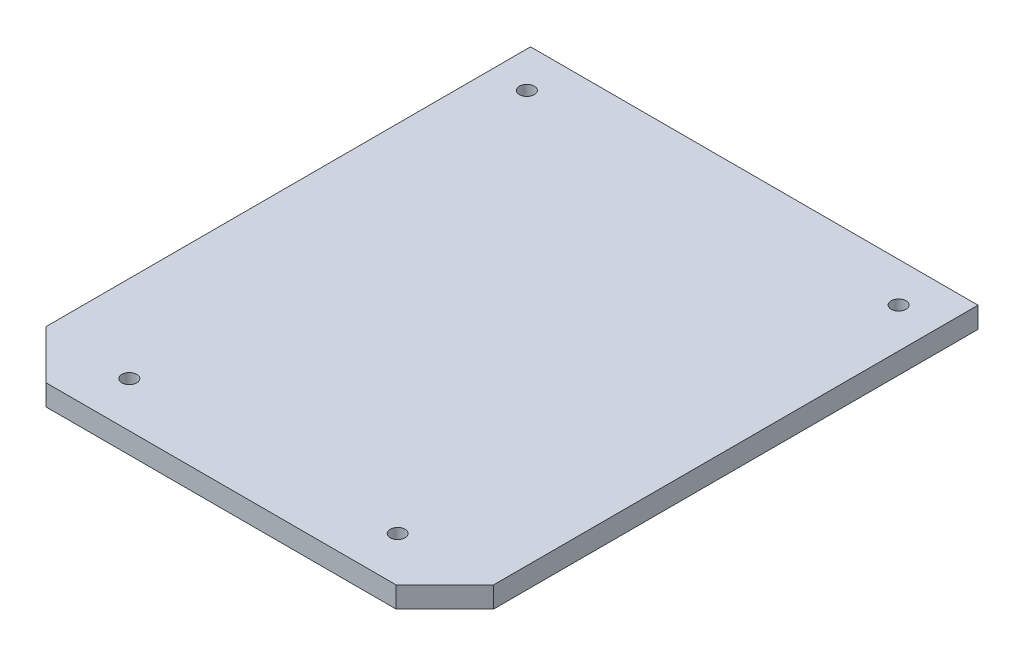
ISO-10303-21;
HEADER;
FILE_DESCRIPTION(('STEP AP214'),'2;1');
FILE_NAME('part.step','',(''),(''),'','','');
FILE_SCHEMA(('AUTOMOTIVE_DESIGN { 1 0 10303 214 1 1 1 1 }'));
ENDSEC;
DATA;
#1=APPLICATION_CONTEXT('core data for automotive mechanical design processes');
#2=APPLICATION_PROTOCOL_DEFINITION('international standard','automotive_design',2000,#1);
#3=PRODUCT_CONTEXT('',#1,'mechanical');
#4=PRODUCT('Part','Part','',(#3));
#5=PRODUCT_RELATED_PRODUCT_CATEGORY('part','',(#4));
#6=PRODUCT_DEFINITION_FORMATION('','',#4);
#7=PRODUCT_DEFINITION_CONTEXT('part definition',#1,'design');
#8=PRODUCT_DEFINITION('design','',#6,#7);
#9=PRODUCT_DEFINITION_SHAPE('','',#8);
#10=(LENGTH_UNIT() NAMED_UNIT(*) SI_UNIT(.MILLI.,.METRE.));
#11=(NAMED_UNIT(*) PLANE_ANGLE_UNIT() SI_UNIT($,.RADIAN.));
#12=(NAMED_UNIT(*) SI_UNIT($,.STERADIAN.) SOLID_ANGLE_UNIT());
#13=UNCERTAINTY_MEASURE_WITH_UNIT(LENGTH_MEASURE(1.E-05),#10,'distance_accuracy_value','');
#14=(GEOMETRIC_REPRESENTATION_CONTEXT(3) GLOBAL_UNCERTAINTY_ASSIGNED_CONTEXT((#13)) GLOBAL_UNIT_ASSIGNED_CONTEXT((#10,
#11,#12)) REPRESENTATION_CONTEXT('',''));
#15=CARTESIAN_POINT('',(0.,0.,0.));
#16=DIRECTION('',(0.,0.,1.));
#17=DIRECTION('',(1.,0.,0.));
#18=AXIS2_PLACEMENT_3D('',#15,#16,#17);
#19=CARTESIAN_POINT('',(-3.39087512506615,1.01536082259858,-29.6898459275896));
#20=DIRECTION('',(0.,0.,-1.));
#21=DIRECTION('',(-1.,0.,0.));
#22=AXIS2_PLACEMENT_3D('',#19,#20,#21);
#23=PLANE('',#22);
#24=DIRECTION('',(-1.,0.,0.));
#25=VECTOR('',#24,1.);
#26=CARTESIAN_POINT('',(-3.39087512506615,2.01536082259858,-29.6898459275896));
#27=LINE('',#26,#25);
#28=CARTESIAN_POINT('',(-3.39087512506615,2.01536082259858,-29.6898459275896));
#29=VERTEX_POINT('',#28);
#30=CARTESIAN_POINT('',(-24.7167465234432,2.01536082259858,-29.6898459275896));
#31=VERTEX_POINT('',#30);
#32=EDGE_CURVE('E117',#29,#31,#27,.T.);
#33=ORIENTED_EDGE('',*,*,#32,.F.);
#34=DIRECTION('',(0.,1.,0.));
#35=VECTOR('',#34,1.);
#36=CARTESIAN_POINT('',(-3.39087512506615,1.01536082259858,-29.6898459275896));
#37=LINE('',#36,#35);
#38=CARTESIAN_POINT('',(-3.39087512506615,1.01536082259858,-29.6898459275896));
#39=VERTEX_POINT('',#38);
#40=EDGE_CURVE('E11',#39,#29,#37,.T.);
#41=ORIENTED_EDGE('',*,*,#40,.F.);
#42=DIRECTION('',(-1.,0.,0.));
#43=VECTOR('',#42,1.);
#44=CARTESIAN_POINT('',(-3.39087512506615,1.01536082259858,-29.6898459275896));
#45=LINE('',#44,#43);
#46=CARTESIAN_POINT('',(-24.7167465234432,1.01536082259858,-29.6898459275896));
#47=VERTEX_POINT('',#46);
#48=EDGE_CURVE('E132',#39,#47,#45,.T.);
#49=ORIENTED_EDGE('',*,*,#48,.T.);
#50=DIRECTION('',(0.,1.,0.));
#51=VECTOR('',#50,1.);
#52=CARTESIAN_POINT('',(-24.7167465234432,1.01536082259858,-29.6898459275896));
#53=LINE('',#52,#51);
#54=EDGE_CURVE('E35',#47,#31,#53,.T.);
#55=ORIENTED_EDGE('',*,*,#54,.T.);
#56=EDGE_LOOP('',(#33,#41,#49,#55));
#57=FACE_BOUND('',#56,.T.);
#58=ADVANCED_FACE('F32',(#57),#23,.T.);
#59=CARTESIAN_POINT('',(-3.39087512506615,1.01536082259858,-6.5966371205072));
#60=DIRECTION('',(1.,0.,0.));
#61=DIRECTION('',(0.,0.,-1.));
#62=AXIS2_PLACEMENT_3D('',#59,#60,#61);
#63=PLANE('',#62);
#64=DIRECTION('',(0.,0.,-1.));
#65=VECTOR('',#64,1.);
#66=CARTESIAN_POINT('',(-3.39087512506615,2.01536082259858,-6.5966371205072));
#67=LINE('',#66,#65);
#68=CARTESIAN_POINT('',(-3.39087512506615,2.01536082259858,-6.5966371205072));
#69=VERTEX_POINT('',#68);
#70=EDGE_CURVE('E130',#69,#29,#67,.T.);
#71=ORIENTED_EDGE('',*,*,#70,.F.);
#72=DIRECTION('',(0.,1.,0.));
#73=VECTOR('',#72,1.);
#74=CARTESIAN_POINT('',(-3.39087512506615,1.01536082259858,-6.5966371205072));
#75=LINE('',#74,#73);
#76=CARTESIAN_POINT('',(-3.39087512506615,1.01536082259858,-6.5966371205072));
#77=VERTEX_POINT('',#76);
#78=EDGE_CURVE('E41',#77,#69,#75,.T.);
#79=ORIENTED_EDGE('',*,*,#78,.F.);
#80=DIRECTION('',(0.,0.,-1.));
#81=VECTOR('',#80,1.);
#82=CARTESIAN_POINT('',(-3.39087512506615,1.01536082259858,-6.5966371205072));
#83=LINE('',#82,#81);
#84=EDGE_CURVE('E107',#77,#39,#83,.T.);
#85=ORIENTED_EDGE('',*,*,#84,.T.);
#86=ORIENTED_EDGE('',*,*,#40,.T.);
#87=EDGE_LOOP('',(#71,#79,#85,#86));
#88=FACE_BOUND('',#87,.T.);
#89=ADVANCED_FACE('F140',(#88),#63,.T.);
#90=CARTESIAN_POINT('',(-5.70805083870186,1.01536082259858,-4.27946140687141));
#91=DIRECTION('',(0.707106781186559,0.,0.707106781186536));
#92=DIRECTION('',(0.707106781186536,0.,-0.707106781186559));
#93=AXIS2_PLACEMENT_3D('',#90,#91,#92);
#94=PLANE('',#93);
#95=DIRECTION('',(0.707106781186536,0.,-0.707106781186559));
#96=VECTOR('',#95,1.);
#97=CARTESIAN_POINT('',(-5.70805083870186,2.01536082259858,-4.27946140687141));
#98=LINE('',#97,#96);
#99=CARTESIAN_POINT('',(-5.70805083870186,2.01536082259858,-4.27946140687141));
#100=VERTEX_POINT('',#99);
#101=EDGE_CURVE('E94',#100,#69,#98,.T.);
#102=ORIENTED_EDGE('',*,*,#101,.F.);
#103=DIRECTION('',(0.,1.,0.));
#104=VECTOR('',#103,1.);
#105=CARTESIAN_POINT('',(-5.70805083870186,1.01536082259858,-4.27946140687141));
#106=LINE('',#105,#104);
#107=CARTESIAN_POINT('',(-5.70805083870186,1.01536082259858,-4.27946140687141));
#108=VERTEX_POINT('',#107);
#109=EDGE_CURVE('E89',#108,#100,#106,.T.);
#110=ORIENTED_EDGE('',*,*,#109,.F.);
#111=DIRECTION('',(0.707106781186536,0.,-0.707106781186559));
#112=VECTOR('',#111,1.);
#113=CARTESIAN_POINT('',(-5.70805083870186,1.01536082259858,-4.27946140687141));
#114=LINE('',#113,#112);
#115=EDGE_CURVE('E92',#108,#77,#114,.T.);
#116=ORIENTED_EDGE('',*,*,#115,.T.);
#117=ORIENTED_EDGE('',*,*,#78,.T.);
#118=EDGE_LOOP('',(#102,#110,#116,#117));
#119=FACE_BOUND('',#118,.T.);
#120=ADVANCED_FACE('F91',(#119),#94,.T.);
#121=CARTESIAN_POINT('',(-22.3995708098073,1.01536082259858,-4.27946140687141));
#122=DIRECTION('',(0.,0.,1.));
#123=DIRECTION('',(1.,0.,0.));
#124=AXIS2_PLACEMENT_3D('',#121,#122,#123);
#125=PLANE('',#124);
#126=DIRECTION('',(1.,0.,0.));
#127=VECTOR('',#126,1.);
#128=CARTESIAN_POINT('',(-22.3995708098073,2.01536082259858,-4.27946140687141));
#129=LINE('',#128,#127);
#130=CARTESIAN_POINT('',(-22.3995708098073,2.01536082259858,-4.27946140687141));
#131=VERTEX_POINT('',#130);
#132=EDGE_CURVE('E127',#131,#100,#129,.T.);
#133=ORIENTED_EDGE('',*,*,#132,.F.);
#134=DIRECTION('',(0.,1.,0.));
#135=VECTOR('',#134,1.);
#136=CARTESIAN_POINT('',(-22.3995708098073,1.01536082259858,-4.27946140687141));
#137=LINE('',#136,#135);
#138=CARTESIAN_POINT('',(-22.3995708098073,1.01536082259858,-4.27946140687141));
#139=VERTEX_POINT('',#138);
#140=EDGE_CURVE('E99',#139,#131,#137,.T.);
#141=ORIENTED_EDGE('',*,*,#140,.F.);
#142=DIRECTION('',(1.,0.,0.));
#143=VECTOR('',#142,1.);
#144=CARTESIAN_POINT('',(-22.3995708098073,1.01536082259858,-4.27946140687141));
#145=LINE('',#144,#143);
#146=EDGE_CURVE('E105',#139,#108,#145,.T.);
#147=ORIENTED_EDGE('',*,*,#146,.T.);
#148=ORIENTED_EDGE('',*,*,#109,.T.);
#149=EDGE_LOOP('',(#133,#141,#147,#148));
#150=FACE_BOUND('',#149,.T.);
#151=ADVANCED_FACE('F109',(#150),#125,.T.);
#152=CARTESIAN_POINT('',(-24.7167465234432,1.01536082259858,-6.5966371205072));
#153=DIRECTION('',(-0.707106781186536,0.,0.707106781186559));
#154=DIRECTION('',(0.707106781186559,0.,0.707106781186536));
#155=AXIS2_PLACEMENT_3D('',#152,#153,#154);
#156=PLANE('',#155);
#157=DIRECTION('',(0.707106781186559,0.,0.707106781186536));
#158=VECTOR('',#157,1.);
#159=CARTESIAN_POINT('',(-24.7167465234432,2.01536082259858,-6.5966371205072));
#160=LINE('',#159,#158);
#161=CARTESIAN_POINT('',(-24.7167465234432,2.01536082259858,-6.5966371205072));
#162=VERTEX_POINT('',#161);
#163=EDGE_CURVE('E124',#162,#131,#160,.T.);
#164=ORIENTED_EDGE('',*,*,#163,.F.);
#165=DIRECTION('',(0.,1.,0.));
#166=VECTOR('',#165,1.);
#167=CARTESIAN_POINT('',(-24.7167465234432,1.01536082259858,-6.5966371205072));
#168=LINE('',#167,#166);
#169=CARTESIAN_POINT('',(-24.7167465234432,1.01536082259858,-6.5966371205072));
#170=VERTEX_POINT('',#169);
#171=EDGE_CURVE('E135',#170,#162,#168,.T.);
#172=ORIENTED_EDGE('',*,*,#171,.F.);
#173=DIRECTION('',(0.707106781186559,0.,0.707106781186536));
#174=VECTOR('',#173,1.);
#175=CARTESIAN_POINT('',(-24.7167465234432,1.01536082259858,-6.5966371205072));
#176=LINE('',#175,#174);
#177=EDGE_CURVE('E110',#170,#139,#176,.T.);
#178=ORIENTED_EDGE('',*,*,#177,.T.);
#179=ORIENTED_EDGE('',*,*,#140,.T.);
#180=EDGE_LOOP('',(#164,#172,#178,#179));
#181=FACE_BOUND('',#180,.T.);
#182=ADVANCED_FACE('F153',(#181),#156,.T.);
#183=CARTESIAN_POINT('',(-24.7167465234432,1.01536082259858,-29.6898459275896));
#184=DIRECTION('',(-1.,0.,0.));
#185=DIRECTION('',(0.,0.,1.));
#186=AXIS2_PLACEMENT_3D('',#183,#184,#185);
#187=PLANE('',#186);
#188=DIRECTION('',(0.,0.,1.));
#189=VECTOR('',#188,1.);
#190=CARTESIAN_POINT('',(-24.7167465234432,2.01536082259858,-29.6898459275896));
#191=LINE('',#190,#189);
#192=EDGE_CURVE('E120',#31,#162,#191,.T.);
#193=ORIENTED_EDGE('',*,*,#192,.F.);
#194=ORIENTED_EDGE('',*,*,#54,.F.);
#195=DIRECTION('',(0.,0.,1.));
#196=VECTOR('',#195,1.);
#197=CARTESIAN_POINT('',(-24.7167465234432,1.01536082259858,-29.6898459275896));
#198=LINE('',#197,#196);
#199=EDGE_CURVE('E112',#47,#170,#198,.T.);
#200=ORIENTED_EDGE('',*,*,#199,.T.);
#201=ORIENTED_EDGE('',*,*,#171,.T.);
#202=EDGE_LOOP('',(#193,#194,#200,#201));
#203=FACE_BOUND('',#202,.T.);
#204=ADVANCED_FACE('F137',(#203),#187,.T.);
#205=CARTESIAN_POINT('',(0.,1.01536082259858,0.));
#206=DIRECTION('',(0.,1.,0.));
#207=DIRECTION('',(0.,0.,1.));
#208=AXIS2_PLACEMENT_3D('',#205,#206,#207);
#209=PLANE('',#208);
#210=CARTESIAN_POINT('',(-7.79516568522584,1.01536082259858,-6.4354081412286));
#211=DIRECTION('',(0.,1.,0.));
#212=DIRECTION('',(0.,0.,1.));
#213=AXIS2_PLACEMENT_3D('',#210,#211,#212);
#214=CIRCLE('',#213,0.353838885629441);
#215=CARTESIAN_POINT('',(-7.79516568522584,1.01536082259858,-6.08156925559916));
#216=VERTEX_POINT('',#215);
#217=EDGE_CURVE('E190',#216,#216,#214,.T.);
#218=ORIENTED_EDGE('',*,*,#217,.T.);
#219=EDGE_LOOP('',(#218));
#220=FACE_BOUND('',#219,.T.);
#221=CARTESIAN_POINT('',(-20.5850019568735,1.01536082259858,-6.4354081412286));
#222=DIRECTION('',(0.,1.,0.));
#223=DIRECTION('',(0.,0.,1.));
#224=AXIS2_PLACEMENT_3D('',#221,#222,#223);
#225=CIRCLE('',#224,0.353838885629441);
#226=CARTESIAN_POINT('',(-20.5850019568735,1.01536082259858,-6.08156925559916));
#227=VERTEX_POINT('',#226);
#228=EDGE_CURVE('E194',#227,#227,#225,.T.);
#229=ORIENTED_EDGE('',*,*,#228,.T.);
#230=EDGE_LOOP('',(#229));
#231=FACE_BOUND('',#230,.T.);
#232=CARTESIAN_POINT('',(-5.2891346139113,1.01536082259858,-27.8045610314031));
#233=DIRECTION('',(0.,1.,0.));
#234=DIRECTION('',(0.,0.,1.));
#235=AXIS2_PLACEMENT_3D('',#232,#233,#234);
#236=CIRCLE('',#235,0.353838885629441);
#237=CARTESIAN_POINT('',(-5.2891346139113,1.01536082259858,-27.4507221457737));
#238=VERTEX_POINT('',#237);
#239=EDGE_CURVE('E203',#238,#238,#236,.T.);
#240=ORIENTED_EDGE('',*,*,#239,.T.);
#241=EDGE_LOOP('',(#240));
#242=FACE_BOUND('',#241,.T.);
#243=CARTESIAN_POINT('',(-23.0068454262019,1.01536082259858,-27.8045610314031));
#244=DIRECTION('',(0.,1.,0.));
#245=DIRECTION('',(0.,0.,1.));
#246=AXIS2_PLACEMENT_3D('',#243,#244,#245);
#247=CIRCLE('',#246,0.353838885629441);
#248=CARTESIAN_POINT('',(-23.0068454262019,1.01536082259858,-27.4507221457737));
#249=VERTEX_POINT('',#248);
#250=EDGE_CURVE('E121',#249,#249,#247,.T.);
#251=ORIENTED_EDGE('',*,*,#250,.T.);
#252=EDGE_LOOP('',(#251));
#253=FACE_BOUND('',#252,.T.);
#254=ORIENTED_EDGE('',*,*,#48,.F.);
#255=ORIENTED_EDGE('',*,*,#84,.F.);
#256=ORIENTED_EDGE('',*,*,#115,.F.);
#257=ORIENTED_EDGE('',*,*,#146,.F.);
#258=ORIENTED_EDGE('',*,*,#177,.F.);
#259=ORIENTED_EDGE('',*,*,#199,.F.);
#260=EDGE_LOOP('',(#254,#255,#256,#257,#258,#259));
#261=FACE_BOUND('',#260,.T.);
#262=ADVANCED_FACE('F103',(#220,#231,#242,#253,#261),#209,.F.);
#263=CARTESIAN_POINT('',(0.,2.01536082259858,0.));
#264=DIRECTION('',(0.,1.,0.));
#265=DIRECTION('',(0.,0.,1.));
#266=AXIS2_PLACEMENT_3D('',#263,#264,#265);
#267=PLANE('',#266);
#268=CARTESIAN_POINT('',(-7.79516568522584,2.01536082259858,-6.4354081412286));
#269=DIRECTION('',(0.,1.,0.));
#270=DIRECTION('',(0.,0.,1.));
#271=AXIS2_PLACEMENT_3D('',#268,#269,#270);
#272=CIRCLE('',#271,0.353838885629441);
#273=CARTESIAN_POINT('',(-7.79516568522584,2.01536082259858,-6.08156925559916));
#274=VERTEX_POINT('',#273);
#275=EDGE_CURVE('E188',#274,#274,#272,.T.);
#276=ORIENTED_EDGE('',*,*,#275,.F.);
#277=EDGE_LOOP('',(#276));
#278=FACE_BOUND('',#277,.T.);
#279=CARTESIAN_POINT('',(-20.5850019568735,2.01536082259858,-6.4354081412286));
#280=DIRECTION('',(0.,1.,0.));
#281=DIRECTION('',(0.,0.,1.));
#282=AXIS2_PLACEMENT_3D('',#279,#280,#281);
#283=CIRCLE('',#282,0.353838885629441);
#284=CARTESIAN_POINT('',(-20.5850019568735,2.01536082259858,-6.08156925559916));
#285=VERTEX_POINT('',#284);
#286=EDGE_CURVE('E191',#285,#285,#283,.T.);
#287=ORIENTED_EDGE('',*,*,#286,.F.);
#288=EDGE_LOOP('',(#287));
#289=FACE_BOUND('',#288,.T.);
#290=CARTESIAN_POINT('',(-5.2891346139113,2.01536082259858,-27.8045610314031));
#291=DIRECTION('',(0.,1.,0.));
#292=DIRECTION('',(0.,0.,1.));
#293=AXIS2_PLACEMENT_3D('',#290,#291,#292);
#294=CIRCLE('',#293,0.353838885629441);
#295=CARTESIAN_POINT('',(-5.2891346139113,2.01536082259858,-27.4507221457737));
#296=VERTEX_POINT('',#295);
#297=EDGE_CURVE('E200',#296,#296,#294,.T.);
#298=ORIENTED_EDGE('',*,*,#297,.F.);
#299=EDGE_LOOP('',(#298));
#300=FACE_BOUND('',#299,.T.);
#301=CARTESIAN_POINT('',(-23.0068454262019,2.01536082259858,-27.8045610314031));
#302=DIRECTION('',(0.,1.,0.));
#303=DIRECTION('',(0.,0.,1.));
#304=AXIS2_PLACEMENT_3D('',#301,#302,#303);
#305=CIRCLE('',#304,0.353838885629441);
#306=CARTESIAN_POINT('',(-23.0068454262019,2.01536082259858,-27.4507221457737));
#307=VERTEX_POINT('',#306);
#308=EDGE_CURVE('E206',#307,#307,#305,.T.);
#309=ORIENTED_EDGE('',*,*,#308,.F.);
#310=EDGE_LOOP('',(#309));
#311=FACE_BOUND('',#310,.T.);
#312=ORIENTED_EDGE('',*,*,#32,.T.);
#313=ORIENTED_EDGE('',*,*,#192,.T.);
#314=ORIENTED_EDGE('',*,*,#163,.T.);
#315=ORIENTED_EDGE('',*,*,#132,.T.);
#316=ORIENTED_EDGE('',*,*,#101,.T.);
#317=ORIENTED_EDGE('',*,*,#70,.T.);
#318=EDGE_LOOP('',(#312,#313,#314,#315,#316,#317));
#319=FACE_BOUND('',#318,.T.);
#320=ADVANCED_FACE('F139',(#278,#289,#300,#311,#319),#267,.T.);
#321=CARTESIAN_POINT('',(-23.0068454262019,-1.98463917740142,-27.8045610314031));
#322=DIRECTION('',(0.,1.,0.));
#323=DIRECTION('',(0.,0.,1.));
#324=AXIS2_PLACEMENT_3D('',#321,#322,#323);
#325=CYLINDRICAL_SURFACE('',#324,0.353838885629441);
#326=ORIENTED_EDGE('',*,*,#308,.T.);
#327=EDGE_LOOP('',(#326));
#328=FACE_BOUND('',#327,.T.);
#329=ORIENTED_EDGE('',*,*,#250,.F.);
#330=EDGE_LOOP('',(#329));
#331=FACE_BOUND('',#330,.T.);
#332=ADVANCED_FACE('F164',(#328,#331),#325,.F.);
#333=CARTESIAN_POINT('',(-5.2891346139113,-1.98463917740142,-27.8045610314031));
#334=DIRECTION('',(0.,1.,0.));
#335=DIRECTION('',(0.,0.,1.));
#336=AXIS2_PLACEMENT_3D('',#333,#334,#335);
#337=CYLINDRICAL_SURFACE('',#336,0.353838885629441);
#338=ORIENTED_EDGE('',*,*,#297,.T.);
#339=EDGE_LOOP('',(#338));
#340=FACE_BOUND('',#339,.T.);
#341=ORIENTED_EDGE('',*,*,#239,.F.);
#342=EDGE_LOOP('',(#341));
#343=FACE_BOUND('',#342,.T.);
#344=ADVANCED_FACE('F171',(#340,#343),#337,.F.);
#345=CARTESIAN_POINT('',(-20.5850019568735,-1.98463917740142,-6.4354081412286));
#346=DIRECTION('',(0.,1.,0.));
#347=DIRECTION('',(0.,0.,1.));
#348=AXIS2_PLACEMENT_3D('',#345,#346,#347);
#349=CYLINDRICAL_SURFACE('',#348,0.353838885629441);
#350=ORIENTED_EDGE('',*,*,#286,.T.);
#351=EDGE_LOOP('',(#350));
#352=FACE_BOUND('',#351,.T.);
#353=ORIENTED_EDGE('',*,*,#228,.F.);
#354=EDGE_LOOP('',(#353));
#355=FACE_BOUND('',#354,.T.);
#356=ADVANCED_FACE('F175',(#352,#355),#349,.F.);
#357=CARTESIAN_POINT('',(-7.79516568522584,-1.98463917740142,-6.4354081412286));
#358=DIRECTION('',(0.,1.,0.));
#359=DIRECTION('',(0.,0.,1.));
#360=AXIS2_PLACEMENT_3D('',#357,#358,#359);
#361=CYLINDRICAL_SURFACE('',#360,0.353838885629441);
#362=ORIENTED_EDGE('',*,*,#275,.T.);
#363=EDGE_LOOP('',(#362));
#364=FACE_BOUND('',#363,.T.);
#365=ORIENTED_EDGE('',*,*,#217,.F.);
#366=EDGE_LOOP('',(#365));
#367=FACE_BOUND('',#366,.T.);
#368=ADVANCED_FACE('F179',(#364,#367),#361,.F.);
#369=CLOSED_SHELL('',(#58,#89,#120,#151,#182,#204,#262,#320,#332,#344,#356,#368));
#370=MANIFOLD_SOLID_BREP('B2',#369);
#371=ADVANCED_BREP_SHAPE_REPRESENTATION('',(#18,#370),#14);
#372=SHAPE_DEFINITION_REPRESENTATION(#9,#371);
ENDSEC;
END-ISO-10303-21;
